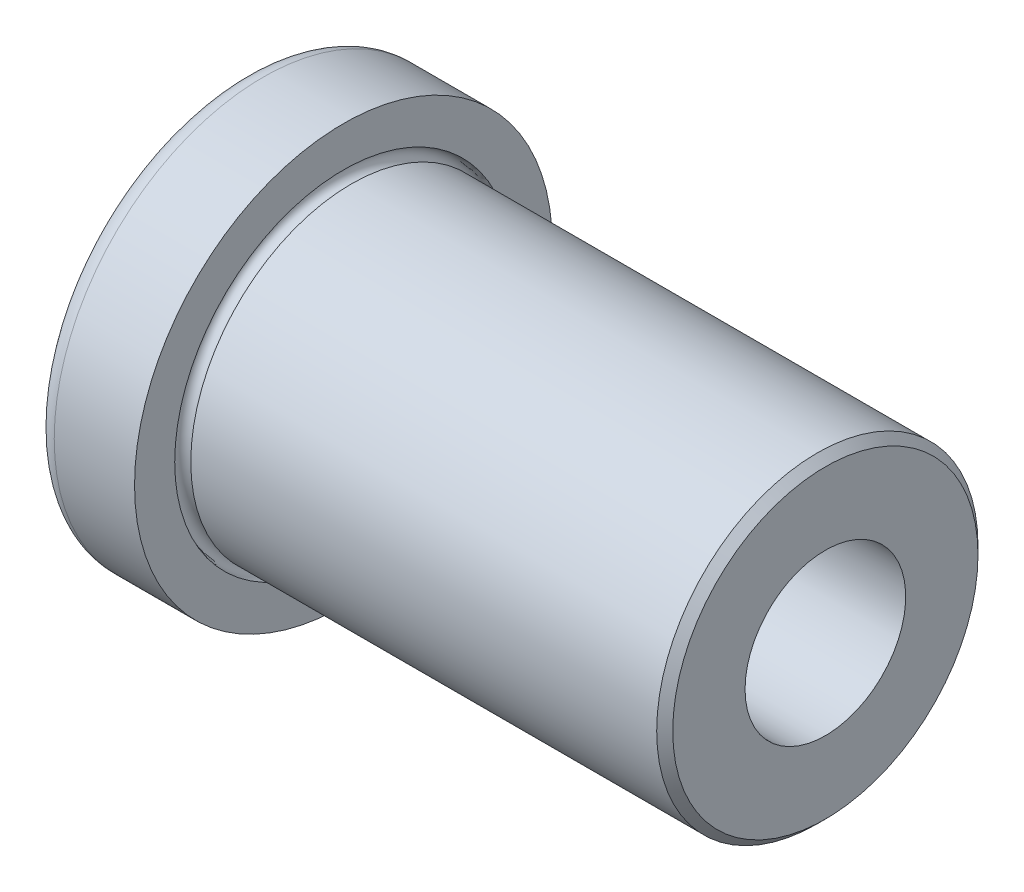
ISO-10303-21;
HEADER;
FILE_DESCRIPTION(('STEP AP214'),'2;1');
FILE_NAME('part.step','',(''),(''),'','','');
FILE_SCHEMA(('AUTOMOTIVE_DESIGN { 1 0 10303 214 1 1 1 1 }'));
ENDSEC;
DATA;
#1=APPLICATION_CONTEXT('core data for automotive mechanical design processes');
#2=APPLICATION_PROTOCOL_DEFINITION('international standard','automotive_design',2000,#1);
#3=PRODUCT_CONTEXT('',#1,'mechanical');
#4=PRODUCT('Part','Part','',(#3));
#5=PRODUCT_RELATED_PRODUCT_CATEGORY('part','',(#4));
#6=PRODUCT_DEFINITION_FORMATION('','',#4);
#7=PRODUCT_DEFINITION_CONTEXT('part definition',#1,'design');
#8=PRODUCT_DEFINITION('design','',#6,#7);
#9=PRODUCT_DEFINITION_SHAPE('','',#8);
#10=(LENGTH_UNIT() NAMED_UNIT(*) SI_UNIT(.MILLI.,.METRE.));
#11=(NAMED_UNIT(*) PLANE_ANGLE_UNIT() SI_UNIT($,.RADIAN.));
#12=(NAMED_UNIT(*) SI_UNIT($,.STERADIAN.) SOLID_ANGLE_UNIT());
#13=UNCERTAINTY_MEASURE_WITH_UNIT(LENGTH_MEASURE(1.E-05),#10,'distance_accuracy_value','');
#14=(GEOMETRIC_REPRESENTATION_CONTEXT(3) GLOBAL_UNCERTAINTY_ASSIGNED_CONTEXT((#13)) GLOBAL_UNIT_ASSIGNED_CONTEXT((#10,
#11,#12)) REPRESENTATION_CONTEXT('',''));
#15=CARTESIAN_POINT('',(0.,0.,0.));
#16=DIRECTION('',(0.,0.,1.));
#17=DIRECTION('',(1.,0.,0.));
#18=AXIS2_PLACEMENT_3D('',#15,#16,#17);
#19=CARTESIAN_POINT('',(3.9624,8.255,0.));
#20=DIRECTION('',(1.,0.,0.));
#21=DIRECTION('',(0.,0.,-1.));
#22=AXIS2_PLACEMENT_3D('',#19,#20,#21);
#23=PLANE('',#22);
#24=CARTESIAN_POINT('',(3.9624,0.,0.));
#25=DIRECTION('',(-1.,0.,0.));
#26=DIRECTION('',(0.,0.,1.));
#27=AXIS2_PLACEMENT_3D('',#24,#25,#26);
#28=CIRCLE('',#27,6.6675);
#29=CARTESIAN_POINT('',(3.9624,0.,6.6675));
#30=VERTEX_POINT('',#29);
#31=EDGE_CURVE('E65',#30,#30,#28,.T.);
#32=ORIENTED_EDGE('',*,*,#31,.T.);
#33=EDGE_LOOP('',(#32));
#34=FACE_BOUND('',#33,.T.);
#35=CARTESIAN_POINT('',(3.9624,0.,0.));
#36=DIRECTION('',(-1.,0.,0.));
#37=DIRECTION('',(0.,0.,1.));
#38=AXIS2_PLACEMENT_3D('',#35,#36,#37);
#39=CIRCLE('',#38,8.255);
#40=CARTESIAN_POINT('',(3.9624,0.,8.255));
#41=VERTEX_POINT('',#40);
#42=EDGE_CURVE('E10',#41,#41,#39,.T.);
#43=ORIENTED_EDGE('',*,*,#42,.F.);
#44=EDGE_LOOP('',(#43));
#45=FACE_BOUND('',#44,.T.);
#46=ADVANCED_FACE('F31',(#34,#45),#23,.T.);
#47=CARTESIAN_POINT('',(0.,0.,0.));
#48=DIRECTION('',(-1.,0.,0.));
#49=DIRECTION('',(0.,0.,1.));
#50=AXIS2_PLACEMENT_3D('',#47,#48,#49);
#51=CYLINDRICAL_SURFACE('',#50,8.255);
#52=ORIENTED_EDGE('',*,*,#42,.T.);
#53=EDGE_LOOP('',(#52));
#54=FACE_BOUND('',#53,.T.);
#55=CARTESIAN_POINT('',(0.7874,0.,0.));
#56=DIRECTION('',(-1.,0.,0.));
#57=DIRECTION('',(0.,0.,1.));
#58=AXIS2_PLACEMENT_3D('',#55,#56,#57);
#59=CIRCLE('',#58,8.255);
#60=CARTESIAN_POINT('',(0.7874,0.,8.255));
#61=VERTEX_POINT('',#60);
#62=EDGE_CURVE('E37',#61,#61,#59,.T.);
#63=ORIENTED_EDGE('',*,*,#62,.F.);
#64=EDGE_LOOP('',(#63));
#65=FACE_BOUND('',#64,.T.);
#66=ADVANCED_FACE('F83',(#54,#65),#51,.T.);
#67=CARTESIAN_POINT('',(0.7874,0.,0.));
#68=DIRECTION('',(-1.,0.,0.));
#69=DIRECTION('',(0.,0.,1.));
#70=AXIS2_PLACEMENT_3D('',#67,#68,#69);
#71=TOROIDAL_SURFACE('',#70,7.4676,0.7874);
#72=CARTESIAN_POINT('',(0.,0.,0.));
#73=DIRECTION('',(-1.,0.,0.));
#74=DIRECTION('',(0.,0.,1.));
#75=AXIS2_PLACEMENT_3D('',#72,#73,#74);
#76=CIRCLE('',#75,7.4676);
#77=CARTESIAN_POINT('',(0.,0.,7.4676));
#78=VERTEX_POINT('',#77);
#79=EDGE_CURVE('E41',#78,#78,#76,.T.);
#80=ORIENTED_EDGE('',*,*,#79,.F.);
#81=EDGE_LOOP('',(#80));
#82=FACE_BOUND('',#81,.T.);
#83=ORIENTED_EDGE('',*,*,#62,.T.);
#84=EDGE_LOOP('',(#83));
#85=FACE_BOUND('',#84,.T.);
#86=ADVANCED_FACE('F87',(#82,#85),#71,.T.);
#87=CARTESIAN_POINT('',(0.,3.96239999999999,0.));
#88=DIRECTION('',(-1.,0.,0.));
#89=DIRECTION('',(0.,0.,1.));
#90=AXIS2_PLACEMENT_3D('',#87,#88,#89);
#91=PLANE('',#90);
#92=ORIENTED_EDGE('',*,*,#79,.T.);
#93=EDGE_LOOP('',(#92));
#94=FACE_BOUND('',#93,.T.);
#95=CARTESIAN_POINT('',(0.,0.,0.));
#96=DIRECTION('',(-1.,0.,0.));
#97=DIRECTION('',(0.,0.,1.));
#98=AXIS2_PLACEMENT_3D('',#95,#96,#97);
#99=CIRCLE('',#98,3.96239999999999);
#100=CARTESIAN_POINT('',(0.,0.,3.96239999999999));
#101=VERTEX_POINT('',#100);
#102=EDGE_CURVE('E45',#101,#101,#99,.T.);
#103=ORIENTED_EDGE('',*,*,#102,.F.);
#104=EDGE_LOOP('',(#103));
#105=FACE_BOUND('',#104,.T.);
#106=ADVANCED_FACE('F91',(#94,#105),#91,.T.);
#107=CARTESIAN_POINT('',(0.787400000000001,0.,0.));
#108=DIRECTION('',(-1.,0.,0.));
#109=DIRECTION('',(0.,0.,1.));
#110=AXIS2_PLACEMENT_3D('',#107,#108,#109);
#111=TOROIDAL_SURFACE('',#110,3.96239999999999,0.787399999999999);
#112=CARTESIAN_POINT('',(0.787400000000001,0.,0.));
#113=DIRECTION('',(-1.,0.,0.));
#114=DIRECTION('',(0.,0.,1.));
#115=AXIS2_PLACEMENT_3D('',#112,#113,#114);
#116=CIRCLE('',#115,3.175);
#117=CARTESIAN_POINT('',(0.787400000000001,0.,3.175));
#118=VERTEX_POINT('',#117);
#119=EDGE_CURVE('E50',#118,#118,#116,.T.);
#120=ORIENTED_EDGE('',*,*,#119,.F.);
#121=EDGE_LOOP('',(#120));
#122=FACE_BOUND('',#121,.T.);
#123=ORIENTED_EDGE('',*,*,#102,.T.);
#124=EDGE_LOOP('',(#123));
#125=FACE_BOUND('',#124,.T.);
#126=ADVANCED_FACE('F98',(#122,#125),#111,.T.);
#127=CARTESIAN_POINT('',(0.,0.,0.));
#128=DIRECTION('',(-1.,0.,0.));
#129=DIRECTION('',(0.,0.,1.));
#130=AXIS2_PLACEMENT_3D('',#127,#128,#129);
#131=CYLINDRICAL_SURFACE('',#130,3.175);
#132=ORIENTED_EDGE('',*,*,#119,.T.);
#133=EDGE_LOOP('',(#132));
#134=FACE_BOUND('',#133,.T.);
#135=CARTESIAN_POINT('',(23.0124,0.,0.));
#136=DIRECTION('',(-1.,0.,0.));
#137=DIRECTION('',(0.,0.,1.));
#138=AXIS2_PLACEMENT_3D('',#135,#136,#137);
#139=CIRCLE('',#138,3.175);
#140=CARTESIAN_POINT('',(23.0124,0.,3.175));
#141=VERTEX_POINT('',#140);
#142=EDGE_CURVE('E53',#141,#141,#139,.T.);
#143=ORIENTED_EDGE('',*,*,#142,.F.);
#144=EDGE_LOOP('',(#143));
#145=FACE_BOUND('',#144,.T.);
#146=ADVANCED_FACE('F102',(#134,#145),#131,.F.);
#147=CARTESIAN_POINT('',(23.0124,6.0325,0.));
#148=DIRECTION('',(1.,0.,0.));
#149=DIRECTION('',(0.,0.,-1.));
#150=AXIS2_PLACEMENT_3D('',#147,#148,#149);
#151=PLANE('',#150);
#152=ORIENTED_EDGE('',*,*,#142,.T.);
#153=EDGE_LOOP('',(#152));
#154=FACE_BOUND('',#153,.T.);
#155=CARTESIAN_POINT('',(23.0124,0.,0.));
#156=DIRECTION('',(-1.,0.,0.));
#157=DIRECTION('',(0.,0.,1.));
#158=AXIS2_PLACEMENT_3D('',#155,#156,#157);
#159=CIRCLE('',#158,6.0325);
#160=CARTESIAN_POINT('',(23.0124,0.,6.0325));
#161=VERTEX_POINT('',#160);
#162=EDGE_CURVE('E56',#161,#161,#159,.T.);
#163=ORIENTED_EDGE('',*,*,#162,.F.);
#164=EDGE_LOOP('',(#163));
#165=FACE_BOUND('',#164,.T.);
#166=ADVANCED_FACE('F106',(#154,#165),#151,.T.);
#167=CARTESIAN_POINT('',(22.6949,0.,0.));
#168=DIRECTION('',(-1.,0.,0.));
#169=DIRECTION('',(0.,0.,1.));
#170=AXIS2_PLACEMENT_3D('',#167,#168,#169);
#171=CONICAL_SURFACE('',#170,6.35,0.785398163397446);
#172=ORIENTED_EDGE('',*,*,#162,.T.);
#173=EDGE_LOOP('',(#172));
#174=FACE_BOUND('',#173,.T.);
#175=CARTESIAN_POINT('',(22.6949,0.,0.));
#176=DIRECTION('',(-1.,0.,0.));
#177=DIRECTION('',(0.,0.,1.));
#178=AXIS2_PLACEMENT_3D('',#175,#176,#177);
#179=CIRCLE('',#178,6.35);
#180=CARTESIAN_POINT('',(22.6949,0.,6.35));
#181=VERTEX_POINT('',#180);
#182=EDGE_CURVE('E59',#181,#181,#179,.T.);
#183=ORIENTED_EDGE('',*,*,#182,.F.);
#184=EDGE_LOOP('',(#183));
#185=FACE_BOUND('',#184,.T.);
#186=ADVANCED_FACE('F79',(#174,#185),#171,.T.);
#187=CARTESIAN_POINT('',(0.,0.,0.));
#188=DIRECTION('',(-1.,0.,0.));
#189=DIRECTION('',(0.,0.,1.));
#190=AXIS2_PLACEMENT_3D('',#187,#188,#189);
#191=CYLINDRICAL_SURFACE('',#190,6.35);
#192=ORIENTED_EDGE('',*,*,#182,.T.);
#193=EDGE_LOOP('',(#192));
#194=FACE_BOUND('',#193,.T.);
#195=CARTESIAN_POINT('',(4.2799,0.,0.));
#196=DIRECTION('',(-1.,0.,0.));
#197=DIRECTION('',(0.,0.,1.));
#198=AXIS2_PLACEMENT_3D('',#195,#196,#197);
#199=CIRCLE('',#198,6.35);
#200=CARTESIAN_POINT('',(4.2799,0.,6.35));
#201=VERTEX_POINT('',#200);
#202=EDGE_CURVE('E62',#201,#201,#199,.T.);
#203=ORIENTED_EDGE('',*,*,#202,.F.);
#204=EDGE_LOOP('',(#203));
#205=FACE_BOUND('',#204,.T.);
#206=ADVANCED_FACE('F73',(#194,#205),#191,.T.);
#207=CARTESIAN_POINT('',(3.9624,0.,0.));
#208=DIRECTION('',(-1.,0.,0.));
#209=DIRECTION('',(0.,0.,1.));
#210=AXIS2_PLACEMENT_3D('',#207,#208,#209);
#211=TOROIDAL_SURFACE('',#210,6.35,0.3175);
#212=ORIENTED_EDGE('',*,*,#202,.T.);
#213=EDGE_LOOP('',(#212));
#214=FACE_BOUND('',#213,.T.);
#215=ORIENTED_EDGE('',*,*,#31,.F.);
#216=EDGE_LOOP('',(#215));
#217=FACE_BOUND('',#216,.T.);
#218=ADVANCED_FACE('F71',(#214,#217),#211,.F.);
#219=CLOSED_SHELL('',(#46,#66,#86,#106,#126,#146,#166,#186,#206,#218));
#220=MANIFOLD_SOLID_BREP('B2',#219);
#221=ADVANCED_BREP_SHAPE_REPRESENTATION('',(#18,#220),#14);
#222=SHAPE_DEFINITION_REPRESENTATION(#9,#221);
ENDSEC;
END-ISO-10303-21;
